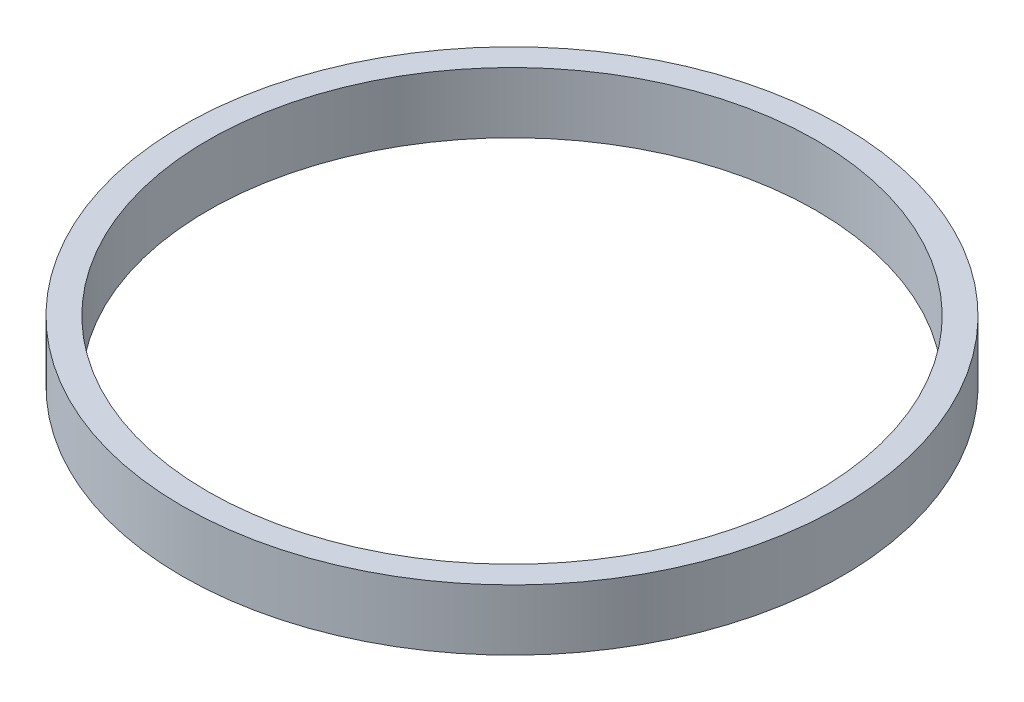
ISO-10303-21;
HEADER;
FILE_DESCRIPTION(('STEP AP214'),'2;1');
FILE_NAME('part.step','',(''),(''),'','','');
FILE_SCHEMA(('AUTOMOTIVE_DESIGN { 1 0 10303 214 1 1 1 1 }'));
ENDSEC;
DATA;
#1=APPLICATION_CONTEXT('core data for automotive mechanical design processes');
#2=APPLICATION_PROTOCOL_DEFINITION('international standard','automotive_design',2000,#1);
#3=PRODUCT_CONTEXT('',#1,'mechanical');
#4=PRODUCT('Part','Part','',(#3));
#5=PRODUCT_RELATED_PRODUCT_CATEGORY('part','',(#4));
#6=PRODUCT_DEFINITION_FORMATION('','',#4);
#7=PRODUCT_DEFINITION_CONTEXT('part definition',#1,'design');
#8=PRODUCT_DEFINITION('design','',#6,#7);
#9=PRODUCT_DEFINITION_SHAPE('','',#8);
#10=(LENGTH_UNIT() NAMED_UNIT(*) SI_UNIT(.MILLI.,.METRE.));
#11=(NAMED_UNIT(*) PLANE_ANGLE_UNIT() SI_UNIT($,.RADIAN.));
#12=(NAMED_UNIT(*) SI_UNIT($,.STERADIAN.) SOLID_ANGLE_UNIT());
#13=UNCERTAINTY_MEASURE_WITH_UNIT(LENGTH_MEASURE(1.E-05),#10,'distance_accuracy_value','');
#14=(GEOMETRIC_REPRESENTATION_CONTEXT(3) GLOBAL_UNCERTAINTY_ASSIGNED_CONTEXT((#13)) GLOBAL_UNIT_ASSIGNED_CONTEXT((#10,
#11,#12)) REPRESENTATION_CONTEXT('',''));
#15=CARTESIAN_POINT('',(0.,0.,0.));
#16=DIRECTION('',(0.,0.,1.));
#17=DIRECTION('',(1.,0.,0.));
#18=AXIS2_PLACEMENT_3D('',#15,#16,#17);
#19=CARTESIAN_POINT('',(0.,6.,0.));
#20=DIRECTION('',(0.,1.,0.));
#21=DIRECTION('',(0.,0.,1.));
#22=AXIS2_PLACEMENT_3D('',#19,#20,#21);
#23=PLANE('',#22);
#24=CARTESIAN_POINT('',(0.,6.,0.));
#25=DIRECTION('',(0.,1.,0.));
#26=DIRECTION('',(0.,0.,1.));
#27=AXIS2_PLACEMENT_3D('',#24,#25,#26);
#28=CIRCLE('',#27,32.5);
#29=CARTESIAN_POINT('',(0.,6.,32.5));
#30=VERTEX_POINT('',#29);
#31=EDGE_CURVE('E12',#30,#30,#28,.T.);
#32=ORIENTED_EDGE('',*,*,#31,.T.);
#33=EDGE_LOOP('',(#32));
#34=FACE_BOUND('',#33,.T.);
#35=CARTESIAN_POINT('',(0.,6.,0.));
#36=DIRECTION('',(0.,1.,0.));
#37=DIRECTION('',(0.,0.,1.));
#38=AXIS2_PLACEMENT_3D('',#35,#36,#37);
#39=CIRCLE('',#38,30.);
#40=CARTESIAN_POINT('',(0.,6.,30.));
#41=VERTEX_POINT('',#40);
#42=EDGE_CURVE('E51',#41,#41,#39,.T.);
#43=ORIENTED_EDGE('',*,*,#42,.F.);
#44=EDGE_LOOP('',(#43));
#45=FACE_BOUND('',#44,.T.);
#46=ADVANCED_FACE('F40',(#34,#45),#23,.T.);
#47=CARTESIAN_POINT('',(0.,0.,0.));
#48=DIRECTION('',(0.,1.,0.));
#49=DIRECTION('',(0.,0.,1.));
#50=AXIS2_PLACEMENT_3D('',#47,#48,#49);
#51=PLANE('',#50);
#52=CARTESIAN_POINT('',(0.,0.,0.));
#53=DIRECTION('',(0.,1.,0.));
#54=DIRECTION('',(0.,0.,1.));
#55=AXIS2_PLACEMENT_3D('',#52,#53,#54);
#56=CIRCLE('',#55,32.5);
#57=CARTESIAN_POINT('',(0.,0.,32.5));
#58=VERTEX_POINT('',#57);
#59=EDGE_CURVE('E44',#58,#58,#56,.T.);
#60=ORIENTED_EDGE('',*,*,#59,.F.);
#61=EDGE_LOOP('',(#60));
#62=FACE_BOUND('',#61,.T.);
#63=CARTESIAN_POINT('',(0.,0.,0.));
#64=DIRECTION('',(0.,1.,0.));
#65=DIRECTION('',(0.,0.,1.));
#66=AXIS2_PLACEMENT_3D('',#63,#64,#65);
#67=CIRCLE('',#66,30.);
#68=CARTESIAN_POINT('',(0.,0.,30.));
#69=VERTEX_POINT('',#68);
#70=EDGE_CURVE('E53',#69,#69,#67,.T.);
#71=ORIENTED_EDGE('',*,*,#70,.T.);
#72=EDGE_LOOP('',(#71));
#73=FACE_BOUND('',#72,.T.);
#74=ADVANCED_FACE('F63',(#62,#73),#51,.F.);
#75=CARTESIAN_POINT('',(0.,6.,0.));
#76=DIRECTION('',(0.,-1.,0.));
#77=DIRECTION('',(0.,0.,-1.));
#78=AXIS2_PLACEMENT_3D('',#75,#76,#77);
#79=CYLINDRICAL_SURFACE('',#78,32.5);
#80=ORIENTED_EDGE('',*,*,#31,.F.);
#81=EDGE_LOOP('',(#80));
#82=FACE_BOUND('',#81,.T.);
#83=ORIENTED_EDGE('',*,*,#59,.T.);
#84=EDGE_LOOP('',(#83));
#85=FACE_BOUND('',#84,.T.);
#86=ADVANCED_FACE('F42',(#82,#85),#79,.T.);
#87=CARTESIAN_POINT('',(0.,6.,0.));
#88=DIRECTION('',(0.,-1.,0.));
#89=DIRECTION('',(0.,0.,-1.));
#90=AXIS2_PLACEMENT_3D('',#87,#88,#89);
#91=CYLINDRICAL_SURFACE('',#90,30.);
#92=ORIENTED_EDGE('',*,*,#42,.T.);
#93=EDGE_LOOP('',(#92));
#94=FACE_BOUND('',#93,.T.);
#95=ORIENTED_EDGE('',*,*,#70,.F.);
#96=EDGE_LOOP('',(#95));
#97=FACE_BOUND('',#96,.T.);
#98=ADVANCED_FACE('F59',(#94,#97),#91,.F.);
#99=CLOSED_SHELL('',(#46,#74,#86,#98));
#100=MANIFOLD_SOLID_BREP('B2',#99);
#101=ADVANCED_BREP_SHAPE_REPRESENTATION('',(#18,#100),#14);
#102=SHAPE_DEFINITION_REPRESENTATION(#9,#101);
ENDSEC;
END-ISO-10303-21;
